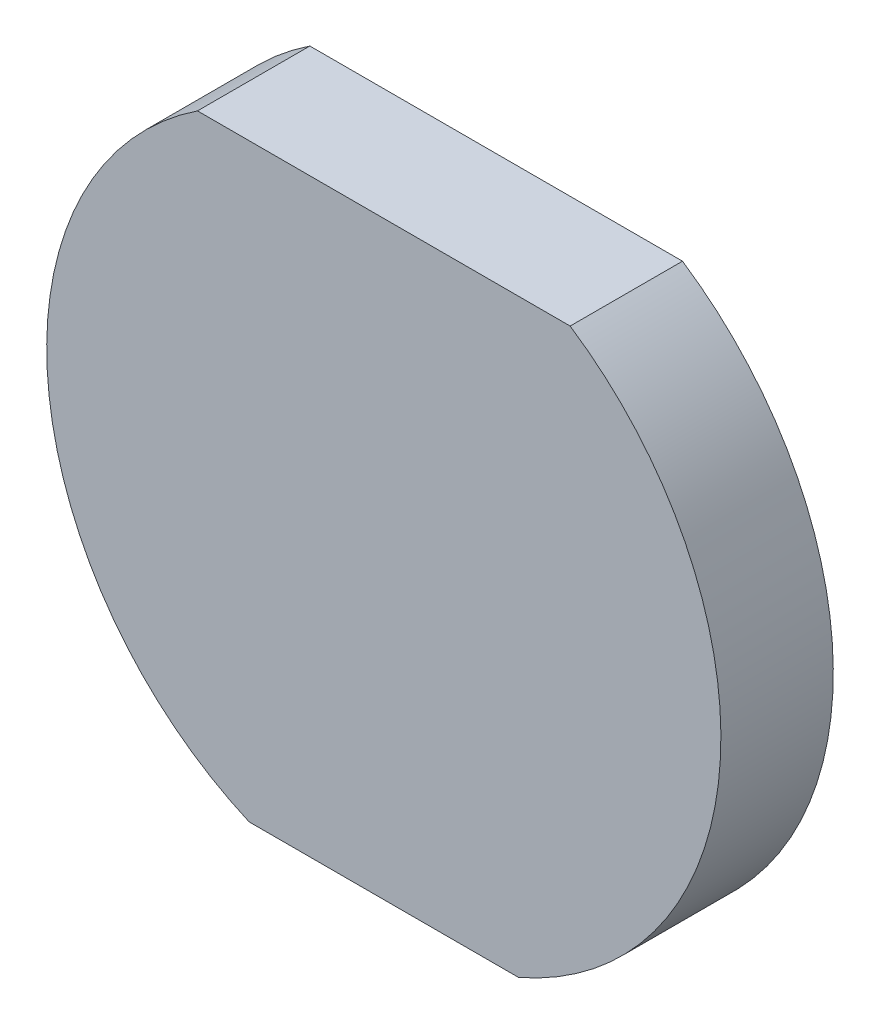
ISO-10303-21;
HEADER;
FILE_DESCRIPTION(('STEP AP214'),'2;1');
FILE_NAME('part.step','',(''),(''),'','','');
FILE_SCHEMA(('AUTOMOTIVE_DESIGN { 1 0 10303 214 1 1 1 1 }'));
ENDSEC;
DATA;
#1=APPLICATION_CONTEXT('core data for automotive mechanical design processes');
#2=APPLICATION_PROTOCOL_DEFINITION('international standard','automotive_design',2000,#1);
#3=PRODUCT_CONTEXT('',#1,'mechanical');
#4=PRODUCT('Part','Part','',(#3));
#5=PRODUCT_RELATED_PRODUCT_CATEGORY('part','',(#4));
#6=PRODUCT_DEFINITION_FORMATION('','',#4);
#7=PRODUCT_DEFINITION_CONTEXT('part definition',#1,'design');
#8=PRODUCT_DEFINITION('design','',#6,#7);
#9=PRODUCT_DEFINITION_SHAPE('','',#8);
#10=(LENGTH_UNIT() NAMED_UNIT(*) SI_UNIT(.MILLI.,.METRE.));
#11=(NAMED_UNIT(*) PLANE_ANGLE_UNIT() SI_UNIT($,.RADIAN.));
#12=(NAMED_UNIT(*) SI_UNIT($,.STERADIAN.) SOLID_ANGLE_UNIT());
#13=UNCERTAINTY_MEASURE_WITH_UNIT(LENGTH_MEASURE(1.E-05),#10,'distance_accuracy_value','');
#14=(GEOMETRIC_REPRESENTATION_CONTEXT(3) GLOBAL_UNCERTAINTY_ASSIGNED_CONTEXT((#13)) GLOBAL_UNIT_ASSIGNED_CONTEXT((#10,
#11,#12)) REPRESENTATION_CONTEXT('',''));
#15=CARTESIAN_POINT('',(0.,0.,0.));
#16=DIRECTION('',(0.,0.,1.));
#17=DIRECTION('',(1.,0.,0.));
#18=AXIS2_PLACEMENT_3D('',#15,#16,#17);
#19=CARTESIAN_POINT('',(0.,0.,2.));
#20=DIRECTION('',(0.,0.,-1.));
#21=DIRECTION('',(-1.,0.,0.));
#22=AXIS2_PLACEMENT_3D('',#19,#20,#21);
#23=CYLINDRICAL_SURFACE('',#22,6.);
#24=CARTESIAN_POINT('',(0.,0.,2.));
#25=DIRECTION('',(0.,0.,1.));
#26=DIRECTION('',(1.,0.,0.));
#27=AXIS2_PLACEMENT_3D('',#24,#25,#26);
#28=CIRCLE('',#27,6.);
#29=CARTESIAN_POINT('',(-3.3166247903554,5.,2.));
#30=VERTEX_POINT('',#29);
#31=CARTESIAN_POINT('',(-2.39791576165636,-5.5,2.));
#32=VERTEX_POINT('',#31);
#33=EDGE_CURVE('E11',#30,#32,#28,.T.);
#34=ORIENTED_EDGE('',*,*,#33,.F.);
#35=DIRECTION('',(0.,0.,1.));
#36=VECTOR('',#35,1.);
#37=CARTESIAN_POINT('',(-3.3166247903554,5.,0.));
#38=LINE('',#37,#36);
#39=CARTESIAN_POINT('',(-3.3166247903554,5.,0.));
#40=VERTEX_POINT('',#39);
#41=EDGE_CURVE('E73',#40,#30,#38,.T.);
#42=ORIENTED_EDGE('',*,*,#41,.F.);
#43=CARTESIAN_POINT('',(0.,0.,0.));
#44=DIRECTION('',(0.,0.,1.));
#45=DIRECTION('',(1.,0.,0.));
#46=AXIS2_PLACEMENT_3D('',#43,#44,#45);
#47=CIRCLE('',#46,6.);
#48=CARTESIAN_POINT('',(-2.39791576165636,-5.5,0.));
#49=VERTEX_POINT('',#48);
#50=EDGE_CURVE('E90',#40,#49,#47,.T.);
#51=ORIENTED_EDGE('',*,*,#50,.T.);
#52=DIRECTION('',(0.,0.,1.));
#53=VECTOR('',#52,1.);
#54=CARTESIAN_POINT('',(-2.39791576165636,-5.5,0.));
#55=LINE('',#54,#53);
#56=EDGE_CURVE('E49',#49,#32,#55,.T.);
#57=ORIENTED_EDGE('',*,*,#56,.T.);
#58=EDGE_LOOP('',(#34,#42,#51,#57));
#59=FACE_BOUND('',#58,.T.);
#60=ADVANCED_FACE('F33',(#59),#23,.T.);
#61=CARTESIAN_POINT('',(2.39791576165636,-5.5,0.));
#62=VERTEX_POINT('',#61);
#63=CARTESIAN_POINT('',(3.3166247903554,5.,0.));
#64=VERTEX_POINT('',#63);
#65=EDGE_CURVE('E37',#62,#64,#47,.T.);
#66=ORIENTED_EDGE('',*,*,#65,.T.);
#67=DIRECTION('',(0.,0.,1.));
#68=VECTOR('',#67,1.);
#69=CARTESIAN_POINT('',(3.3166247903554,5.,0.));
#70=LINE('',#69,#68);
#71=CARTESIAN_POINT('',(3.3166247903554,5.,2.));
#72=VERTEX_POINT('',#71);
#73=EDGE_CURVE('E57',#64,#72,#70,.T.);
#74=ORIENTED_EDGE('',*,*,#73,.T.);
#75=CARTESIAN_POINT('',(2.39791576165636,-5.5,2.));
#76=VERTEX_POINT('',#75);
#77=EDGE_CURVE('E42',#76,#72,#28,.T.);
#78=ORIENTED_EDGE('',*,*,#77,.F.);
#79=DIRECTION('',(0.,0.,1.));
#80=VECTOR('',#79,1.);
#81=CARTESIAN_POINT('',(2.39791576165636,-5.5,0.));
#82=LINE('',#81,#80);
#83=EDGE_CURVE('E91',#62,#76,#82,.T.);
#84=ORIENTED_EDGE('',*,*,#83,.F.);
#85=EDGE_LOOP('',(#66,#74,#78,#84));
#86=FACE_BOUND('',#85,.T.);
#87=ADVANCED_FACE('F35',(#86),#23,.T.);
#88=CARTESIAN_POINT('',(0.,0.,2.));
#89=DIRECTION('',(0.,0.,1.));
#90=DIRECTION('',(1.,0.,0.));
#91=AXIS2_PLACEMENT_3D('',#88,#89,#90);
#92=PLANE('',#91);
#93=DIRECTION('',(1.,0.,0.));
#94=VECTOR('',#93,1.);
#95=CARTESIAN_POINT('',(0.,5.,2.));
#96=LINE('',#95,#94);
#97=EDGE_CURVE('E76',#30,#72,#96,.T.);
#98=ORIENTED_EDGE('',*,*,#97,.F.);
#99=ORIENTED_EDGE('',*,*,#33,.T.);
#100=DIRECTION('',(-1.,0.,0.));
#101=VECTOR('',#100,1.);
#102=CARTESIAN_POINT('',(0.,-5.5,2.));
#103=LINE('',#102,#101);
#104=EDGE_CURVE('E88',#76,#32,#103,.T.);
#105=ORIENTED_EDGE('',*,*,#104,.F.);
#106=ORIENTED_EDGE('',*,*,#77,.T.);
#107=EDGE_LOOP('',(#98,#99,#105,#106));
#108=FACE_BOUND('',#107,.T.);
#109=ADVANCED_FACE('F85',(#108),#92,.T.);
#110=CARTESIAN_POINT('',(0.,0.,0.));
#111=DIRECTION('',(0.,0.,1.));
#112=DIRECTION('',(1.,0.,0.));
#113=AXIS2_PLACEMENT_3D('',#110,#111,#112);
#114=PLANE('',#113);
#115=ORIENTED_EDGE('',*,*,#50,.F.);
#116=DIRECTION('',(1.,0.,0.));
#117=VECTOR('',#116,1.);
#118=CARTESIAN_POINT('',(0.,5.,0.));
#119=LINE('',#118,#117);
#120=EDGE_CURVE('E77',#40,#64,#119,.T.);
#121=ORIENTED_EDGE('',*,*,#120,.T.);
#122=ORIENTED_EDGE('',*,*,#65,.F.);
#123=DIRECTION('',(-1.,0.,0.));
#124=VECTOR('',#123,1.);
#125=CARTESIAN_POINT('',(0.,-5.5,0.));
#126=LINE('',#125,#124);
#127=EDGE_CURVE('E93',#62,#49,#126,.T.);
#128=ORIENTED_EDGE('',*,*,#127,.T.);
#129=EDGE_LOOP('',(#115,#121,#122,#128));
#130=FACE_BOUND('',#129,.T.);
#131=ADVANCED_FACE('F104',(#130),#114,.F.);
#132=CARTESIAN_POINT('',(0.,-5.5,0.));
#133=DIRECTION('',(0.,1.,0.));
#134=DIRECTION('',(0.,0.,1.));
#135=AXIS2_PLACEMENT_3D('',#132,#133,#134);
#136=PLANE('',#135);
#137=ORIENTED_EDGE('',*,*,#104,.T.);
#138=ORIENTED_EDGE('',*,*,#56,.F.);
#139=ORIENTED_EDGE('',*,*,#127,.F.);
#140=ORIENTED_EDGE('',*,*,#83,.T.);
#141=EDGE_LOOP('',(#137,#138,#139,#140));
#142=FACE_BOUND('',#141,.T.);
#143=ADVANCED_FACE('F105',(#142),#136,.F.);
#144=CARTESIAN_POINT('',(0.,5.,0.));
#145=DIRECTION('',(0.,-1.,0.));
#146=DIRECTION('',(0.,0.,-1.));
#147=AXIS2_PLACEMENT_3D('',#144,#145,#146);
#148=PLANE('',#147);
#149=ORIENTED_EDGE('',*,*,#97,.T.);
#150=ORIENTED_EDGE('',*,*,#73,.F.);
#151=ORIENTED_EDGE('',*,*,#120,.F.);
#152=ORIENTED_EDGE('',*,*,#41,.T.);
#153=EDGE_LOOP('',(#149,#150,#151,#152));
#154=FACE_BOUND('',#153,.T.);
#155=ADVANCED_FACE('F75',(#154),#148,.F.);
#156=CLOSED_SHELL('',(#60,#87,#109,#131,#143,#155));
#157=MANIFOLD_SOLID_BREP('B2',#156);
#158=ADVANCED_BREP_SHAPE_REPRESENTATION('',(#18,#157),#14);
#159=SHAPE_DEFINITION_REPRESENTATION(#9,#158);
ENDSEC;
END-ISO-10303-21;
